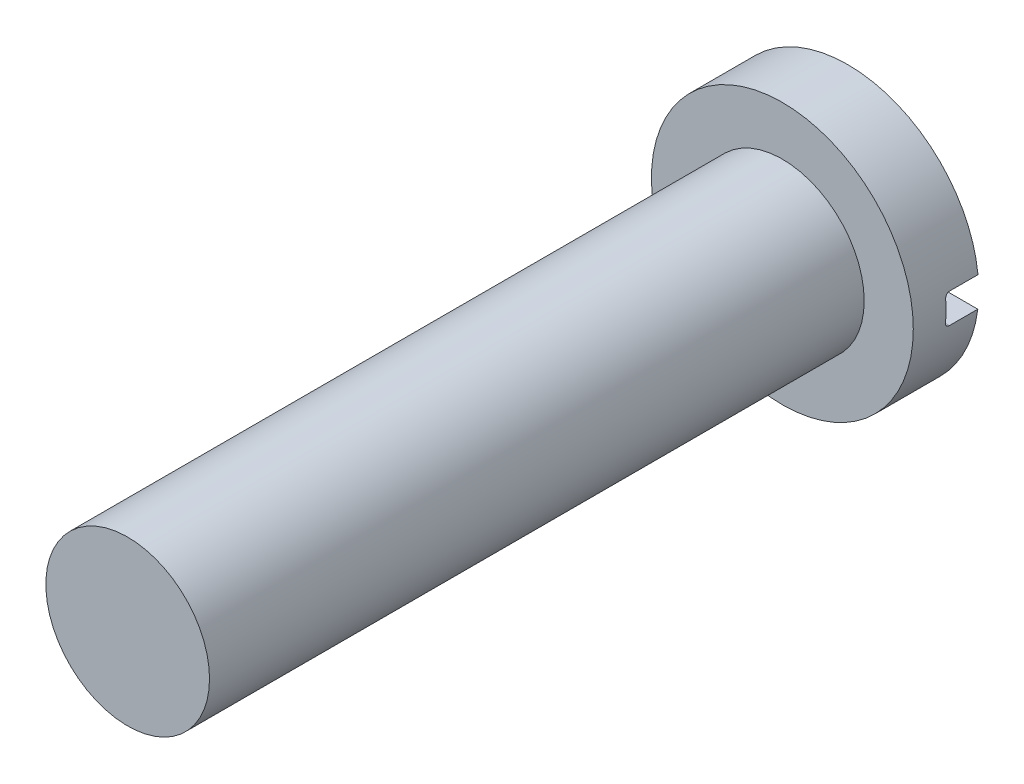
ISO-10303-21;
HEADER;
FILE_DESCRIPTION(('STEP AP214'),'2;1');
FILE_NAME('part.step','',(''),(''),'','','');
FILE_SCHEMA(('AUTOMOTIVE_DESIGN { 1 0 10303 214 1 1 1 1 }'));
ENDSEC;
DATA;
#1=APPLICATION_CONTEXT('core data for automotive mechanical design processes');
#2=APPLICATION_PROTOCOL_DEFINITION('international standard','automotive_design',2000,#1);
#3=PRODUCT_CONTEXT('',#1,'mechanical');
#4=PRODUCT('Part','Part','',(#3));
#5=PRODUCT_RELATED_PRODUCT_CATEGORY('part','',(#4));
#6=PRODUCT_DEFINITION_FORMATION('','',#4);
#7=PRODUCT_DEFINITION_CONTEXT('part definition',#1,'design');
#8=PRODUCT_DEFINITION('design','',#6,#7);
#9=PRODUCT_DEFINITION_SHAPE('','',#8);
#10=(LENGTH_UNIT() NAMED_UNIT(*) SI_UNIT(.MILLI.,.METRE.));
#11=(NAMED_UNIT(*) PLANE_ANGLE_UNIT() SI_UNIT($,.RADIAN.));
#12=(NAMED_UNIT(*) SI_UNIT($,.STERADIAN.) SOLID_ANGLE_UNIT());
#13=UNCERTAINTY_MEASURE_WITH_UNIT(LENGTH_MEASURE(1.E-05),#10,'distance_accuracy_value','');
#14=(GEOMETRIC_REPRESENTATION_CONTEXT(3) GLOBAL_UNCERTAINTY_ASSIGNED_CONTEXT((#13)) GLOBAL_UNIT_ASSIGNED_CONTEXT((#10,
#11,#12)) REPRESENTATION_CONTEXT('',''));
#15=CARTESIAN_POINT('',(0.,0.,0.));
#16=DIRECTION('',(0.,0.,1.));
#17=DIRECTION('',(1.,0.,0.));
#18=AXIS2_PLACEMENT_3D('',#15,#16,#17);
#19=CARTESIAN_POINT('',(0.,0.,1.5));
#20=DIRECTION('',(0.,0.,-1.));
#21=DIRECTION('',(-1.,0.,0.));
#22=AXIS2_PLACEMENT_3D('',#19,#20,#21);
#23=CYLINDRICAL_SURFACE('',#22,3.);
#24=CARTESIAN_POINT('',(0.,0.,1.5));
#25=DIRECTION('',(0.,0.,1.));
#26=DIRECTION('',(1.,0.,0.));
#27=AXIS2_PLACEMENT_3D('',#24,#25,#26);
#28=CIRCLE('',#27,3.);
#29=CARTESIAN_POINT('',(3.,0.,1.5));
#30=VERTEX_POINT('',#29);
#31=EDGE_CURVE('E123',#30,#30,#28,.T.);
#32=ORIENTED_EDGE('',*,*,#31,.F.);
#33=EDGE_LOOP('',(#32));
#34=FACE_BOUND('',#33,.T.);
#35=CARTESIAN_POINT('',(0.,0.,0.75));
#36=DIRECTION('',(0.,0.,-1.));
#37=DIRECTION('',(-1.,0.,0.));
#38=AXIS2_PLACEMENT_3D('',#35,#36,#37);
#39=CIRCLE('',#38,3.);
#40=CARTESIAN_POINT('',(2.99171573670124,0.222793516005652,0.75));
#41=VERTEX_POINT('',#40);
#42=CARTESIAN_POINT('',(2.98836228895146,-0.263990208100195,0.75));
#43=VERTEX_POINT('',#42);
#44=EDGE_CURVE('E214',#41,#43,#39,.T.);
#45=ORIENTED_EDGE('',*,*,#44,.F.);
#46=CARTESIAN_POINT('',(2.99171573670124,0.222793516005652,0.75));
#47=CARTESIAN_POINT('',(2.99129599756721,0.228438156758412,0.750004679741415));
#48=CARTESIAN_POINT('',(2.99085918761105,0.23407995759427,0.749522358439301));
#49=CARTESIAN_POINT('',(2.9899679453911,0.24519742220719,0.747619623071084));
#50=CARTESIAN_POINT('',(2.98951352685014,0.25067320965796,0.746199926216409));
#51=CARTESIAN_POINT('',(2.98860269155907,0.261309680155106,0.742457409008168));
#52=CARTESIAN_POINT('',(2.98814627400409,0.266470220758117,0.740134183839763));
#53=CARTESIAN_POINT('',(2.98725089080267,0.276326908018835,0.734651962904643));
#54=CARTESIAN_POINT('',(2.98681192224983,0.281023132211426,0.731493107002452));
#55=CARTESIAN_POINT('',(2.98597133201027,0.289818525018607,0.724427638446032));
#56=CARTESIAN_POINT('',(2.98556970996288,0.293917699399567,0.720521033014488));
#57=CARTESIAN_POINT('',(2.98482343297435,0.301402146386026,0.712068877904865));
#58=CARTESIAN_POINT('',(2.98447878840207,0.3047872890817,0.707523212207427));
#59=CARTESIAN_POINT('',(2.98386540928372,0.310734877713242,0.697937918980524));
#60=CARTESIAN_POINT('',(2.983596440782,0.313299862632311,0.692899880198982));
#61=CARTESIAN_POINT('',(2.98314758498027,0.317545389048317,0.682461861440111));
#62=CARTESIAN_POINT('',(2.98296763896161,0.319226513579991,0.677062122713994));
#63=CARTESIAN_POINT('',(2.98275315808419,0.321222991127284,0.668022415083843));
#64=CARTESIAN_POINT('',(2.98268965581679,0.321811564981808,0.664441118298576));
#65=CARTESIAN_POINT('',(2.9826047958824,0.322596772609972,0.657240404493619));
#66=CARTESIAN_POINT('',(2.9825833793936,0.322793953423756,0.653621047797164));
#67=CARTESIAN_POINT('',(2.98258350193684,0.322793516005987,0.65000000000007));
#68=B_SPLINE_CURVE_WITH_KNOTS('',3,(#46,#47,#48,#49,#50,#51,#52,#53,#54,#55,#56,#57,#58,#59,#60,
#61,#62,#63,#64,#65,#66,#67),.UNSPECIFIED.,.F.,.F.,(4,2,2,2,2,2,2,2,2,2,4),(0.,
0.0169579089278556,0.033902857912528,0.0508554076373745,0.0678051217056852,0.0847546720610432,
0.101707303536652,0.118606934480496,0.135495403623634,0.146365031850553,0.157219457145735),.UNSPECIFIED.);
#69=CARTESIAN_POINT('',(2.98258350193665,0.322793516005651,0.65));
#70=VERTEX_POINT('',#69);
#71=EDGE_CURVE('E105',#41,#70,#68,.T.);
#72=ORIENTED_EDGE('',*,*,#71,.T.);
#73=DIRECTION('',(0.,0.,-1.));
#74=VECTOR('',#73,1.);
#75=CARTESIAN_POINT('',(2.98258350193665,0.322793516005651,0.75));
#76=LINE('',#75,#74);
#77=CARTESIAN_POINT('',(2.98258350193665,0.322793516005651,0.));
#78=VERTEX_POINT('',#77);
#79=EDGE_CURVE('E98',#70,#78,#76,.T.);
#80=ORIENTED_EDGE('',*,*,#79,.T.);
#81=CARTESIAN_POINT('',(0.,0.,0.));
#82=DIRECTION('',(0.,0.,1.));
#83=DIRECTION('',(1.,0.,0.));
#84=AXIS2_PLACEMENT_3D('',#81,#82,#83);
#85=CIRCLE('',#84,3.);
#86=CARTESIAN_POINT('',(-2.98258350193665,0.322793516005651,0.));
#87=VERTEX_POINT('',#86);
#88=EDGE_CURVE('E103',#78,#87,#85,.T.);
#89=ORIENTED_EDGE('',*,*,#88,.T.);
#90=DIRECTION('',(0.,0.,-1.));
#91=VECTOR('',#90,1.);
#92=CARTESIAN_POINT('',(-2.98258350193665,0.322793516005651,0.75));
#93=LINE('',#92,#91);
#94=CARTESIAN_POINT('',(-2.98258350193665,0.322793516005651,0.65));
#95=VERTEX_POINT('',#94);
#96=EDGE_CURVE('E116',#95,#87,#93,.T.);
#97=ORIENTED_EDGE('',*,*,#96,.F.);
#98=CARTESIAN_POINT('',(-2.98258350193665,0.322793516005651,0.65));
#99=CARTESIAN_POINT('',(-2.98258252428906,0.322798393095776,0.65560432719124));
#100=CARTESIAN_POINT('',(-2.98263445108361,0.322322687272291,0.661206977141096));
#101=CARTESIAN_POINT('',(-2.98283685418459,0.320446407429086,0.672247988155898));
#102=CARTESIAN_POINT('',(-2.9829872339919,0.319046739023877,0.677686504642259));
#103=CARTESIAN_POINT('',(-2.98337939001989,0.315357948614986,0.688252049987923));
#104=CARTESIAN_POINT('',(-2.98362120355152,0.313068463497067,0.693378950694855));
#105=CARTESIAN_POINT('',(-2.9841829049523,0.307668294835609,0.703174523473637));
#106=CARTESIAN_POINT('',(-2.98450278371272,0.304557707095677,0.70784324891678));
#107=CARTESIAN_POINT('',(-2.98520525612383,0.297593369394584,0.716606340431665));
#108=CARTESIAN_POINT('',(-2.98558803382032,0.29373743248015,0.720698953491292));
#109=CARTESIAN_POINT('',(-2.9863968379696,0.285397000188942,0.728180500354143));
#110=CARTESIAN_POINT('',(-2.9868228735826,0.2809123716049,0.731569284651454));
#111=CARTESIAN_POINT('',(-2.98770071366282,0.271417154865327,0.737563919767486));
#112=CARTESIAN_POINT('',(-2.98815264026441,0.266403960703009,0.74016562087188));
#113=CARTESIAN_POINT('',(-2.98906079609782,0.256013053119601,0.744488525942383));
#114=CARTESIAN_POINT('',(-2.98951702279267,0.250635544306494,0.74621021957478));
#115=CARTESIAN_POINT('',(-2.99026703104102,0.241488383524927,0.74830908312997));
#116=CARTESIAN_POINT('',(-2.99056458745951,0.237775833571089,0.748942674324615));
#117=CARTESIAN_POINT('',(-2.99114905409294,0.230307396302999,0.749788100982153));
#118=CARTESIAN_POINT('',(-2.99143597833858,0.226551575350074,0.750000513226479));
#119=CARTESIAN_POINT('',(-2.99171573670125,0.222793516005797,0.750000000000632));
#120=B_SPLINE_CURVE_WITH_KNOTS('',3,(#98,#99,#100,#101,#102,#103,#104,#105,#106,#107,#108,#109,
#110,#111,#112,#113,#114,#115,#116,#117,#118,#119),.UNSPECIFIED.,.F.,.F.,(4,2,2,2,2,2,2,2,2,2,
4),(0.,0.016790138642826,0.0335638449519292,0.050344403433477,0.0671230048783123,
0.0839516054699044,0.100783777111783,0.117703205033434,0.134613208128942,0.145924810290908,
0.157220911107059),.UNSPECIFIED.);
#121=CARTESIAN_POINT('',(-2.99171573670124,0.222793516005652,0.75));
#122=VERTEX_POINT('',#121);
#123=EDGE_CURVE('E147',#95,#122,#120,.T.);
#124=ORIENTED_EDGE('',*,*,#123,.T.);
#125=CARTESIAN_POINT('',(-2.98836228895146,-0.263990208100195,0.75));
#126=VERTEX_POINT('',#125);
#127=EDGE_CURVE('E111',#126,#122,#39,.T.);
#128=ORIENTED_EDGE('',*,*,#127,.F.);
#129=CARTESIAN_POINT('',(-2.98836228895146,-0.263990208100195,0.75));
#130=CARTESIAN_POINT('',(-2.98786370680662,-0.269641179930699,0.750004647935511));
#131=CARTESIAN_POINT('',(-2.98734801768387,-0.275289070151476,0.749521284610753));
#132=CARTESIAN_POINT('',(-2.98630118970978,-0.286418281236109,0.747614440802784));
#133=CARTESIAN_POINT('',(-2.98577006255302,-0.291899722067274,0.746191655074347));
#134=CARTESIAN_POINT('',(-2.98471009325249,-0.302546835163229,0.742440930031555));
#135=CARTESIAN_POINT('',(-2.98418125224522,-0.307712364143076,0.740112583463269));
#136=CARTESIAN_POINT('',(-2.98314744945784,-0.317578101175408,0.734617935759446));
#137=CARTESIAN_POINT('',(-2.98264248358609,-0.322278389111304,0.731451778822836));
#138=CARTESIAN_POINT('',(-2.98167843855576,-0.331079045731177,0.724370566161543));
#139=CARTESIAN_POINT('',(-2.98121934357397,-0.335179621514329,0.720455770047939));
#140=CARTESIAN_POINT('',(-2.98036822318799,-0.342665260333317,0.711985318495004));
#141=CARTESIAN_POINT('',(-2.97997620972948,-0.346050195955134,0.707429549175578));
#142=CARTESIAN_POINT('',(-2.97928030005416,-0.351991242973447,0.697828462564973));
#143=CARTESIAN_POINT('',(-2.97897602626462,-0.354550911563742,0.692785371515856));
#144=CARTESIAN_POINT('',(-2.97846907048128,-0.358784857766472,0.682337149261559));
#145=CARTESIAN_POINT('',(-2.97826631928694,-0.360459738517153,0.676932267519314));
#146=CARTESIAN_POINT('',(-2.97802589219213,-0.362439488529833,0.667909250084615));
#147=CARTESIAN_POINT('',(-2.97795504922508,-0.36302063936869,0.664350200145327));
#148=CARTESIAN_POINT('',(-2.97786039944189,-0.363795941645524,0.657194626315919));
#149=CARTESIAN_POINT('',(-2.97783652703121,-0.363990632779235,0.653598161746377));
#150=CARTESIAN_POINT('',(-2.97783665240527,-0.363990208100501,0.650000000000063));
#151=B_SPLINE_CURVE_WITH_KNOTS('',3,(#129,#130,#131,#132,#133,#134,#135,#136,#137,#138,#139,
#140,#141,#142,#143,#144,#145,#146,#147,#148,#149,#150),.UNSPECIFIED.,.F.,.F.,(4,2,2,2,2,2,2,2,
2,2,4),(0.,0.0169959697417693,0.0339793840825409,0.0509704451485727,0.0679585837144344,
0.0849408418271945,0.101926120954007,0.118837177094921,0.135736690457952,0.146537625136331,
0.157323465534796),.UNSPECIFIED.);
#152=CARTESIAN_POINT('',(-2.97783665240509,-0.363990208100195,0.65));
#153=VERTEX_POINT('',#152);
#154=EDGE_CURVE('E56',#126,#153,#151,.T.);
#155=ORIENTED_EDGE('',*,*,#154,.T.);
#156=DIRECTION('',(0.,0.,-1.));
#157=VECTOR('',#156,1.);
#158=CARTESIAN_POINT('',(-2.97783665240509,-0.363990208100195,0.75));
#159=LINE('',#158,#157);
#160=CARTESIAN_POINT('',(-2.97783665240509,-0.363990208100195,0.));
#161=VERTEX_POINT('',#160);
#162=EDGE_CURVE('E206',#153,#161,#159,.T.);
#163=ORIENTED_EDGE('',*,*,#162,.T.);
#164=CARTESIAN_POINT('',(2.97783665240509,-0.363990208100195,0.));
#165=VERTEX_POINT('',#164);
#166=EDGE_CURVE('E124',#161,#165,#85,.T.);
#167=ORIENTED_EDGE('',*,*,#166,.T.);
#168=DIRECTION('',(0.,0.,-1.));
#169=VECTOR('',#168,1.);
#170=CARTESIAN_POINT('',(2.97783665240509,-0.363990208100195,0.75));
#171=LINE('',#170,#169);
#172=CARTESIAN_POINT('',(2.97783665240509,-0.363990208100195,0.65));
#173=VERTEX_POINT('',#172);
#174=EDGE_CURVE('E110',#173,#165,#171,.T.);
#175=ORIENTED_EDGE('',*,*,#174,.F.);
#176=CARTESIAN_POINT('',(2.97783665240509,-0.363990208100195,0.65));
#177=CARTESIAN_POINT('',(2.97783560327353,-0.363995113091123,0.65559817129648));
#178=CARTESIAN_POINT('',(2.97789406969737,-0.363520417115988,0.661194605272039));
#179=CARTESIAN_POINT('',(2.97812223239142,-0.361648399291853,0.672222985989221));
#180=CARTESIAN_POINT('',(2.97829181430588,-0.360252025986638,0.677655095840384));
#181=CARTESIAN_POINT('',(2.97873452276606,-0.356572373192959,0.688208020951548));
#182=CARTESIAN_POINT('',(2.97900768977038,-0.354288747149938,0.693328713669274));
#183=CARTESIAN_POINT('',(2.97964327113249,-0.348903066481393,0.703112803397559));
#184=CARTESIAN_POINT('',(2.98000567634651,-0.345801095704946,0.707776247191558));
#185=CARTESIAN_POINT('',(2.98080359032864,-0.33885420889217,0.716533767788484));
#186=CARTESIAN_POINT('',(2.98123936707442,-0.335006561314996,0.720625653022228));
#187=CARTESIAN_POINT('',(2.98216277775245,-0.326684347693975,0.728107343024084));
#188=CARTESIAN_POINT('',(2.98265042288006,-0.322209646239343,0.73149699575388));
#189=CARTESIAN_POINT('',(2.98365944960579,-0.312728544574455,0.737500152076176));
#190=CARTESIAN_POINT('',(2.98418103381571,-0.30771880940995,0.740108349525613));
#191=CARTESIAN_POINT('',(2.98523358361631,-0.297334184421962,0.744444672166994));
#192=CARTESIAN_POINT('',(2.98576454396557,-0.291959494113926,0.7461732738995));
#193=CARTESIAN_POINT('',(2.98664380337273,-0.282794149890959,0.748289123669505));
#194=CARTESIAN_POINT('',(2.98699504545879,-0.279060368938116,0.748930172268859));
#195=CARTESIAN_POINT('',(2.98768735915699,-0.271548533630751,0.749785583460614));
#196=CARTESIAN_POINT('',(2.98802844397464,-0.267770546531853,0.750000526235913));
#197=CARTESIAN_POINT('',(2.98836228895147,-0.263990208100353,0.750000000000684));
#198=B_SPLINE_CURVE_WITH_KNOTS('',3,(#176,#177,#178,#179,#180,#181,#182,#183,#184,#185,#186,
#187,#188,#189,#190,#191,#192,#193,#194,#195,#196,#197),.UNSPECIFIED.,.F.,.F.,(4,2,2,2,2,2,2,2,
2,2,4),(0.,0.0167715723783028,0.0335259111572747,0.0502868006504021,0.0670459734591044,
0.0838677397639559,0.100693144303032,0.117630332315053,0.134558334432353,0.145949630002951,
0.15732540457784),.UNSPECIFIED.);
#199=EDGE_CURVE('E11',#173,#43,#198,.T.);
#200=ORIENTED_EDGE('',*,*,#199,.T.);
#201=EDGE_LOOP('',(#45,#72,#80,#89,#97,#124,#128,#155,#163,#167,#175,#200));
#202=FACE_BOUND('',#201,.T.);
#203=ADVANCED_FACE('F41',(#34,#202),#23,.T.);
#204=CARTESIAN_POINT('',(0.,0.,0.));
#205=DIRECTION('',(0.,0.,1.));
#206=DIRECTION('',(1.,0.,0.));
#207=AXIS2_PLACEMENT_3D('',#204,#205,#206);
#208=PLANE('',#207);
#209=DIRECTION('',(-1.,0.,0.));
#210=VECTOR('',#209,1.);
#211=CARTESIAN_POINT('',(0.,0.322793516005651,0.));
#212=LINE('',#211,#210);
#213=EDGE_CURVE('E114',#78,#87,#212,.T.);
#214=ORIENTED_EDGE('',*,*,#213,.T.);
#215=ORIENTED_EDGE('',*,*,#88,.F.);
#216=EDGE_LOOP('',(#214,#215));
#217=FACE_BOUND('',#216,.T.);
#218=ADVANCED_FACE('F121',(#217),#208,.F.);
#219=CARTESIAN_POINT('',(0.,0.,1.5));
#220=DIRECTION('',(0.,0.,1.));
#221=DIRECTION('',(1.,0.,0.));
#222=AXIS2_PLACEMENT_3D('',#219,#220,#221);
#223=PLANE('',#222);
#224=CARTESIAN_POINT('',(0.,0.,1.5));
#225=DIRECTION('',(0.,0.,1.));
#226=DIRECTION('',(1.,0.,0.));
#227=AXIS2_PLACEMENT_3D('',#224,#225,#226);
#228=CIRCLE('',#227,1.875);
#229=CARTESIAN_POINT('',(1.875,0.,1.5));
#230=VERTEX_POINT('',#229);
#231=EDGE_CURVE('E129',#230,#230,#228,.T.);
#232=ORIENTED_EDGE('',*,*,#231,.F.);
#233=EDGE_LOOP('',(#232));
#234=FACE_BOUND('',#233,.T.);
#235=ORIENTED_EDGE('',*,*,#31,.T.);
#236=EDGE_LOOP('',(#235));
#237=FACE_BOUND('',#236,.T.);
#238=ADVANCED_FACE('F179',(#234,#237),#223,.T.);
#239=ORIENTED_EDGE('',*,*,#166,.F.);
#240=DIRECTION('',(-1.,0.,0.));
#241=VECTOR('',#240,1.);
#242=CARTESIAN_POINT('',(0.,-0.363990208100195,0.));
#243=LINE('',#242,#241);
#244=EDGE_CURVE('E119',#165,#161,#243,.T.);
#245=ORIENTED_EDGE('',*,*,#244,.F.);
#246=EDGE_LOOP('',(#239,#245));
#247=FACE_BOUND('',#246,.T.);
#248=ADVANCED_FACE('F180',(#247),#208,.F.);
#249=CARTESIAN_POINT('',(0.,0.,16.5));
#250=DIRECTION('',(0.,0.,-1.));
#251=DIRECTION('',(-1.,0.,0.));
#252=AXIS2_PLACEMENT_3D('',#249,#250,#251);
#253=CYLINDRICAL_SURFACE('',#252,1.875);
#254=CARTESIAN_POINT('',(0.,0.,16.5));
#255=DIRECTION('',(0.,0.,1.));
#256=DIRECTION('',(1.,0.,0.));
#257=AXIS2_PLACEMENT_3D('',#254,#255,#256);
#258=CIRCLE('',#257,1.875);
#259=CARTESIAN_POINT('',(1.875,0.,16.5));
#260=VERTEX_POINT('',#259);
#261=EDGE_CURVE('E132',#260,#260,#258,.T.);
#262=ORIENTED_EDGE('',*,*,#261,.F.);
#263=EDGE_LOOP('',(#262));
#264=FACE_BOUND('',#263,.T.);
#265=ORIENTED_EDGE('',*,*,#231,.T.);
#266=EDGE_LOOP('',(#265));
#267=FACE_BOUND('',#266,.T.);
#268=ADVANCED_FACE('F189',(#264,#267),#253,.T.);
#269=CARTESIAN_POINT('',(0.,0.,16.5));
#270=DIRECTION('',(0.,0.,1.));
#271=DIRECTION('',(1.,0.,0.));
#272=AXIS2_PLACEMENT_3D('',#269,#270,#271);
#273=PLANE('',#272);
#274=ORIENTED_EDGE('',*,*,#261,.T.);
#275=EDGE_LOOP('',(#274));
#276=FACE_BOUND('',#275,.T.);
#277=ADVANCED_FACE('F195',(#276),#273,.T.);
#278=CARTESIAN_POINT('',(0.,0.322793516005651,0.75));
#279=DIRECTION('',(0.,-1.,0.));
#280=DIRECTION('',(0.,0.,-1.));
#281=AXIS2_PLACEMENT_3D('',#278,#279,#280);
#282=PLANE('',#281);
#283=ORIENTED_EDGE('',*,*,#79,.F.);
#284=DIRECTION('',(-1.,0.,0.));
#285=VECTOR('',#284,1.);
#286=CARTESIAN_POINT('',(-2.98258350193665,0.322793516005651,0.65));
#287=LINE('',#286,#285);
#288=EDGE_CURVE('E135',#70,#95,#287,.T.);
#289=ORIENTED_EDGE('',*,*,#288,.T.);
#290=ORIENTED_EDGE('',*,*,#96,.T.);
#291=ORIENTED_EDGE('',*,*,#213,.F.);
#292=EDGE_LOOP('',(#283,#289,#290,#291));
#293=FACE_BOUND('',#292,.T.);
#294=ADVANCED_FACE('F115',(#293),#282,.T.);
#295=CARTESIAN_POINT('',(0.,-0.363990208100195,0.75));
#296=DIRECTION('',(0.,-1.,0.));
#297=DIRECTION('',(0.,0.,-1.));
#298=AXIS2_PLACEMENT_3D('',#295,#296,#297);
#299=PLANE('',#298);
#300=ORIENTED_EDGE('',*,*,#162,.F.);
#301=DIRECTION('',(-1.,0.,0.));
#302=VECTOR('',#301,1.);
#303=CARTESIAN_POINT('',(0.,-0.363990208100195,0.65));
#304=LINE('',#303,#302);
#305=EDGE_CURVE('E63',#153,#173,#304,.F.);
#306=ORIENTED_EDGE('',*,*,#305,.T.);
#307=ORIENTED_EDGE('',*,*,#174,.T.);
#308=ORIENTED_EDGE('',*,*,#244,.T.);
#309=EDGE_LOOP('',(#300,#306,#307,#308));
#310=FACE_BOUND('',#309,.T.);
#311=ADVANCED_FACE('F171',(#310),#299,.F.);
#312=CARTESIAN_POINT('',(0.,0.,0.75));
#313=DIRECTION('',(0.,0.,-1.));
#314=DIRECTION('',(-1.,0.,0.));
#315=AXIS2_PLACEMENT_3D('',#312,#313,#314);
#316=PLANE('',#315);
#317=ORIENTED_EDGE('',*,*,#127,.T.);
#318=DIRECTION('',(-1.,0.,0.));
#319=VECTOR('',#318,1.);
#320=CARTESIAN_POINT('',(2.98258350193665,0.222793516005652,0.75));
#321=LINE('',#320,#319);
#322=EDGE_CURVE('E142',#122,#41,#321,.F.);
#323=ORIENTED_EDGE('',*,*,#322,.T.);
#324=ORIENTED_EDGE('',*,*,#44,.T.);
#325=DIRECTION('',(-1.,0.,0.));
#326=VECTOR('',#325,1.);
#327=CARTESIAN_POINT('',(0.,-0.263990208100195,0.75));
#328=LINE('',#327,#326);
#329=EDGE_CURVE('E138',#43,#126,#328,.T.);
#330=ORIENTED_EDGE('',*,*,#329,.T.);
#331=EDGE_LOOP('',(#317,#323,#324,#330));
#332=FACE_BOUND('',#331,.T.);
#333=ADVANCED_FACE('F163',(#332),#316,.T.);
#334=CARTESIAN_POINT('',(0.,0.222793516005652,0.65));
#335=DIRECTION('',(1.,0.,0.));
#336=DIRECTION('',(0.,0.,-1.));
#337=AXIS2_PLACEMENT_3D('',#334,#335,#336);
#338=CYLINDRICAL_SURFACE('',#337,0.1);
#339=ORIENTED_EDGE('',*,*,#71,.F.);
#340=ORIENTED_EDGE('',*,*,#322,.F.);
#341=ORIENTED_EDGE('',*,*,#123,.F.);
#342=ORIENTED_EDGE('',*,*,#288,.F.);
#343=EDGE_LOOP('',(#339,#340,#341,#342));
#344=FACE_BOUND('',#343,.T.);
#345=ADVANCED_FACE('F160',(#344),#338,.F.);
#346=CARTESIAN_POINT('',(0.,-0.263990208100195,0.65));
#347=DIRECTION('',(-1.,0.,0.));
#348=DIRECTION('',(0.,0.,1.));
#349=AXIS2_PLACEMENT_3D('',#346,#347,#348);
#350=CYLINDRICAL_SURFACE('',#349,0.1);
#351=ORIENTED_EDGE('',*,*,#199,.F.);
#352=ORIENTED_EDGE('',*,*,#305,.F.);
#353=ORIENTED_EDGE('',*,*,#154,.F.);
#354=ORIENTED_EDGE('',*,*,#329,.F.);
#355=EDGE_LOOP('',(#351,#352,#353,#354));
#356=FACE_BOUND('',#355,.T.);
#357=ADVANCED_FACE('F43',(#356),#350,.F.);
#358=CLOSED_SHELL('',(#203,#218,#238,#248,#268,#277,#294,#311,#333,#345,#357));
#359=MANIFOLD_SOLID_BREP('B2',#358);
#360=ADVANCED_BREP_SHAPE_REPRESENTATION('',(#18,#359),#14);
#361=SHAPE_DEFINITION_REPRESENTATION(#9,#360);
ENDSEC;
END-ISO-10303-21;
